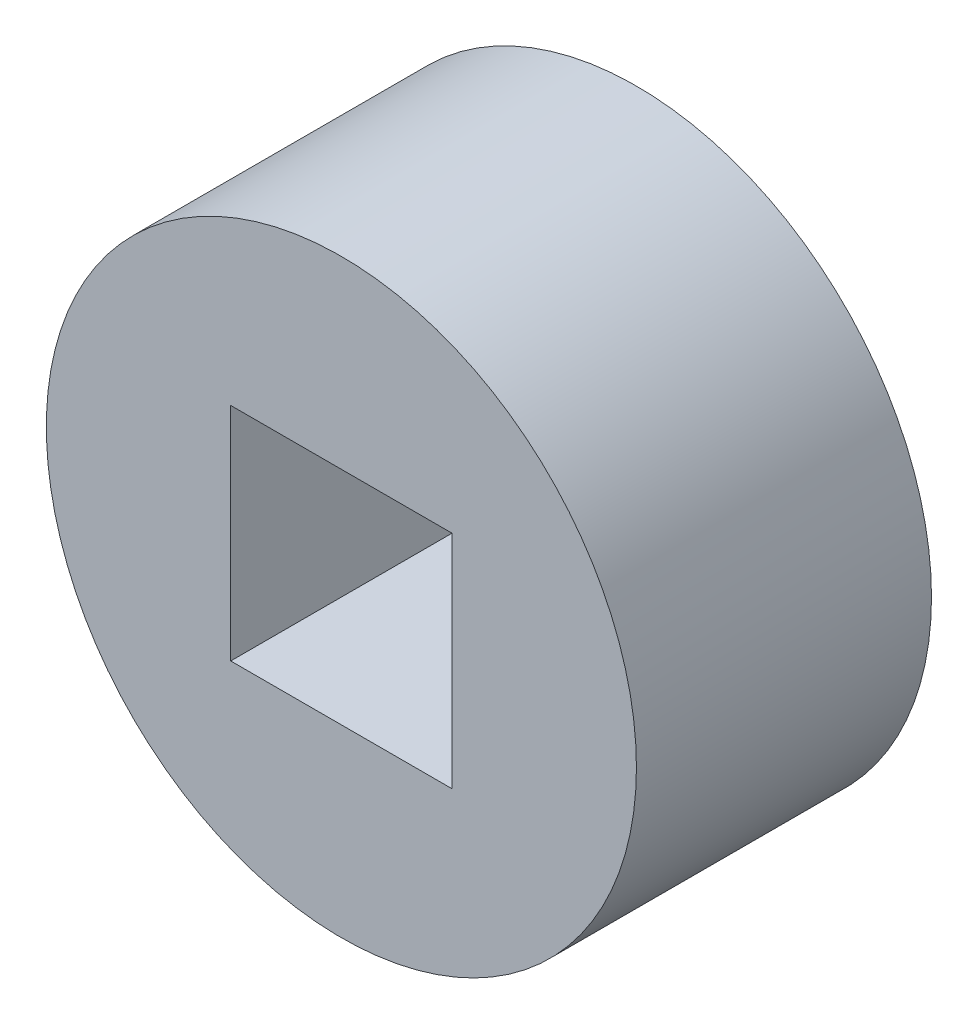
ISO-10303-21;
HEADER;
FILE_DESCRIPTION(('STEP AP214'),'2;1');
FILE_NAME('part.step','',(''),(''),'','','');
FILE_SCHEMA(('AUTOMOTIVE_DESIGN { 1 0 10303 214 1 1 1 1 }'));
ENDSEC;
DATA;
#1=APPLICATION_CONTEXT('core data for automotive mechanical design processes');
#2=APPLICATION_PROTOCOL_DEFINITION('international standard','automotive_design',2000,#1);
#3=PRODUCT_CONTEXT('',#1,'mechanical');
#4=PRODUCT('Part','Part','',(#3));
#5=PRODUCT_RELATED_PRODUCT_CATEGORY('part','',(#4));
#6=PRODUCT_DEFINITION_FORMATION('','',#4);
#7=PRODUCT_DEFINITION_CONTEXT('part definition',#1,'design');
#8=PRODUCT_DEFINITION('design','',#6,#7);
#9=PRODUCT_DEFINITION_SHAPE('','',#8);
#10=(LENGTH_UNIT() NAMED_UNIT(*) SI_UNIT(.MILLI.,.METRE.));
#11=(NAMED_UNIT(*) PLANE_ANGLE_UNIT() SI_UNIT($,.RADIAN.));
#12=(NAMED_UNIT(*) SI_UNIT($,.STERADIAN.) SOLID_ANGLE_UNIT());
#13=UNCERTAINTY_MEASURE_WITH_UNIT(LENGTH_MEASURE(1.E-05),#10,'distance_accuracy_value','');
#14=(GEOMETRIC_REPRESENTATION_CONTEXT(3) GLOBAL_UNCERTAINTY_ASSIGNED_CONTEXT((#13)) GLOBAL_UNIT_ASSIGNED_CONTEXT((#10,
#11,#12)) REPRESENTATION_CONTEXT('',''));
#15=CARTESIAN_POINT('',(0.,0.,0.));
#16=DIRECTION('',(0.,0.,1.));
#17=DIRECTION('',(1.,0.,0.));
#18=AXIS2_PLACEMENT_3D('',#15,#16,#17);
#19=CARTESIAN_POINT('',(0.,0.,4.));
#20=DIRECTION('',(0.,0.,1.));
#21=DIRECTION('',(1.,0.,0.));
#22=AXIS2_PLACEMENT_3D('',#19,#20,#21);
#23=PLANE('',#22);
#24=CARTESIAN_POINT('',(0.,0.,4.));
#25=DIRECTION('',(0.,0.,1.));
#26=DIRECTION('',(1.,0.,0.));
#27=AXIS2_PLACEMENT_3D('',#24,#25,#26);
#28=CIRCLE('',#27,4.);
#29=CARTESIAN_POINT('',(4.,0.,4.));
#30=VERTEX_POINT('',#29);
#31=EDGE_CURVE('E11',#30,#30,#28,.T.);
#32=ORIENTED_EDGE('',*,*,#31,.T.);
#33=EDGE_LOOP('',(#32));
#34=FACE_BOUND('',#33,.T.);
#35=DIRECTION('',(-1.,0.,0.));
#36=VECTOR('',#35,1.);
#37=CARTESIAN_POINT('',(-1.5,1.5,4.));
#38=LINE('',#37,#36);
#39=CARTESIAN_POINT('',(1.5,1.5,4.));
#40=VERTEX_POINT('',#39);
#41=CARTESIAN_POINT('',(-1.5,1.5,4.));
#42=VERTEX_POINT('',#41);
#43=EDGE_CURVE('E90',#40,#42,#38,.T.);
#44=ORIENTED_EDGE('',*,*,#43,.F.);
#45=DIRECTION('',(0.,1.,0.));
#46=VECTOR('',#45,1.);
#47=CARTESIAN_POINT('',(1.5,-1.5,4.));
#48=LINE('',#47,#46);
#49=CARTESIAN_POINT('',(1.5,-1.5,4.));
#50=VERTEX_POINT('',#49);
#51=EDGE_CURVE('E81',#50,#40,#48,.T.);
#52=ORIENTED_EDGE('',*,*,#51,.F.);
#53=DIRECTION('',(1.,0.,0.));
#54=VECTOR('',#53,1.);
#55=CARTESIAN_POINT('',(-1.5,-1.5,4.));
#56=LINE('',#55,#54);
#57=CARTESIAN_POINT('',(-1.5,-1.5,4.));
#58=VERTEX_POINT('',#57);
#59=EDGE_CURVE('E106',#58,#50,#56,.T.);
#60=ORIENTED_EDGE('',*,*,#59,.F.);
#61=DIRECTION('',(0.,-1.,0.));
#62=VECTOR('',#61,1.);
#63=CARTESIAN_POINT('',(-1.5,-1.5,4.));
#64=LINE('',#63,#62);
#65=EDGE_CURVE('E102',#42,#58,#64,.T.);
#66=ORIENTED_EDGE('',*,*,#65,.F.);
#67=EDGE_LOOP('',(#44,#52,#60,#66));
#68=FACE_BOUND('',#67,.T.);
#69=ADVANCED_FACE('F39',(#34,#68),#23,.T.);
#70=CARTESIAN_POINT('',(0.,0.,0.));
#71=DIRECTION('',(0.,0.,1.));
#72=DIRECTION('',(1.,0.,0.));
#73=AXIS2_PLACEMENT_3D('',#70,#71,#72);
#74=PLANE('',#73);
#75=CARTESIAN_POINT('',(0.,0.,0.));
#76=DIRECTION('',(0.,0.,1.));
#77=DIRECTION('',(1.,0.,0.));
#78=AXIS2_PLACEMENT_3D('',#75,#76,#77);
#79=CIRCLE('',#78,4.);
#80=CARTESIAN_POINT('',(4.,0.,0.));
#81=VERTEX_POINT('',#80);
#82=EDGE_CURVE('E43',#81,#81,#79,.T.);
#83=ORIENTED_EDGE('',*,*,#82,.F.);
#84=EDGE_LOOP('',(#83));
#85=FACE_BOUND('',#84,.T.);
#86=DIRECTION('',(0.,1.,0.));
#87=VECTOR('',#86,1.);
#88=CARTESIAN_POINT('',(1.5,-1.5,0.));
#89=LINE('',#88,#87);
#90=CARTESIAN_POINT('',(1.5,-1.5,0.));
#91=VERTEX_POINT('',#90);
#92=CARTESIAN_POINT('',(1.5,1.5,0.));
#93=VERTEX_POINT('',#92);
#94=EDGE_CURVE('E63',#91,#93,#89,.T.);
#95=ORIENTED_EDGE('',*,*,#94,.T.);
#96=DIRECTION('',(-1.,0.,0.));
#97=VECTOR('',#96,1.);
#98=CARTESIAN_POINT('',(-1.5,1.5,0.));
#99=LINE('',#98,#97);
#100=CARTESIAN_POINT('',(-1.5,1.5,0.));
#101=VERTEX_POINT('',#100);
#102=EDGE_CURVE('E97',#93,#101,#99,.T.);
#103=ORIENTED_EDGE('',*,*,#102,.T.);
#104=DIRECTION('',(0.,-1.,0.));
#105=VECTOR('',#104,1.);
#106=CARTESIAN_POINT('',(-1.5,-1.5,0.));
#107=LINE('',#106,#105);
#108=CARTESIAN_POINT('',(-1.5,-1.5,0.));
#109=VERTEX_POINT('',#108);
#110=EDGE_CURVE('E115',#101,#109,#107,.T.);
#111=ORIENTED_EDGE('',*,*,#110,.T.);
#112=DIRECTION('',(1.,0.,0.));
#113=VECTOR('',#112,1.);
#114=CARTESIAN_POINT('',(-1.5,-1.5,0.));
#115=LINE('',#114,#113);
#116=EDGE_CURVE('E91',#109,#91,#115,.T.);
#117=ORIENTED_EDGE('',*,*,#116,.T.);
#118=EDGE_LOOP('',(#95,#103,#111,#117));
#119=FACE_BOUND('',#118,.T.);
#120=ADVANCED_FACE('F131',(#85,#119),#74,.F.);
#121=CARTESIAN_POINT('',(0.,0.,4.));
#122=DIRECTION('',(0.,0.,-1.));
#123=DIRECTION('',(-1.,0.,0.));
#124=AXIS2_PLACEMENT_3D('',#121,#122,#123);
#125=CYLINDRICAL_SURFACE('',#124,4.);
#126=ORIENTED_EDGE('',*,*,#31,.F.);
#127=EDGE_LOOP('',(#126));
#128=FACE_BOUND('',#127,.T.);
#129=ORIENTED_EDGE('',*,*,#82,.T.);
#130=EDGE_LOOP('',(#129));
#131=FACE_BOUND('',#130,.T.);
#132=ADVANCED_FACE('F41',(#128,#131),#125,.T.);
#133=CARTESIAN_POINT('',(1.5,-1.5,4.));
#134=DIRECTION('',(-1.,0.,0.));
#135=DIRECTION('',(0.,0.,1.));
#136=AXIS2_PLACEMENT_3D('',#133,#134,#135);
#137=PLANE('',#136);
#138=ORIENTED_EDGE('',*,*,#94,.F.);
#139=DIRECTION('',(0.,0.,-1.));
#140=VECTOR('',#139,1.);
#141=CARTESIAN_POINT('',(1.5,-1.5,4.));
#142=LINE('',#141,#140);
#143=EDGE_CURVE('E85',#50,#91,#142,.T.);
#144=ORIENTED_EDGE('',*,*,#143,.F.);
#145=ORIENTED_EDGE('',*,*,#51,.T.);
#146=DIRECTION('',(0.,0.,-1.));
#147=VECTOR('',#146,1.);
#148=CARTESIAN_POINT('',(1.5,1.5,4.));
#149=LINE('',#148,#147);
#150=EDGE_CURVE('E84',#40,#93,#149,.T.);
#151=ORIENTED_EDGE('',*,*,#150,.T.);
#152=EDGE_LOOP('',(#138,#144,#145,#151));
#153=FACE_BOUND('',#152,.T.);
#154=ADVANCED_FACE('F83',(#153),#137,.T.);
#155=CARTESIAN_POINT('',(-1.5,1.5,4.));
#156=DIRECTION('',(0.,-1.,0.));
#157=DIRECTION('',(0.,0.,-1.));
#158=AXIS2_PLACEMENT_3D('',#155,#156,#157);
#159=PLANE('',#158);
#160=ORIENTED_EDGE('',*,*,#102,.F.);
#161=ORIENTED_EDGE('',*,*,#150,.F.);
#162=ORIENTED_EDGE('',*,*,#43,.T.);
#163=DIRECTION('',(0.,0.,-1.));
#164=VECTOR('',#163,1.);
#165=CARTESIAN_POINT('',(-1.5,1.5,4.));
#166=LINE('',#165,#164);
#167=EDGE_CURVE('E99',#42,#101,#166,.T.);
#168=ORIENTED_EDGE('',*,*,#167,.T.);
#169=EDGE_LOOP('',(#160,#161,#162,#168));
#170=FACE_BOUND('',#169,.T.);
#171=ADVANCED_FACE('F94',(#170),#159,.T.);
#172=CARTESIAN_POINT('',(-1.5,-1.5,4.));
#173=DIRECTION('',(1.,0.,0.));
#174=DIRECTION('',(0.,0.,-1.));
#175=AXIS2_PLACEMENT_3D('',#172,#173,#174);
#176=PLANE('',#175);
#177=ORIENTED_EDGE('',*,*,#110,.F.);
#178=ORIENTED_EDGE('',*,*,#167,.F.);
#179=ORIENTED_EDGE('',*,*,#65,.T.);
#180=DIRECTION('',(0.,0.,-1.));
#181=VECTOR('',#180,1.);
#182=CARTESIAN_POINT('',(-1.5,-1.5,4.));
#183=LINE('',#182,#181);
#184=EDGE_CURVE('E55',#58,#109,#183,.T.);
#185=ORIENTED_EDGE('',*,*,#184,.T.);
#186=EDGE_LOOP('',(#177,#178,#179,#185));
#187=FACE_BOUND('',#186,.T.);
#188=ADVANCED_FACE('F129',(#187),#176,.T.);
#189=CARTESIAN_POINT('',(-1.5,-1.5,4.));
#190=DIRECTION('',(0.,1.,0.));
#191=DIRECTION('',(0.,0.,1.));
#192=AXIS2_PLACEMENT_3D('',#189,#190,#191);
#193=PLANE('',#192);
#194=ORIENTED_EDGE('',*,*,#116,.F.);
#195=ORIENTED_EDGE('',*,*,#184,.F.);
#196=ORIENTED_EDGE('',*,*,#59,.T.);
#197=ORIENTED_EDGE('',*,*,#143,.T.);
#198=EDGE_LOOP('',(#194,#195,#196,#197));
#199=FACE_BOUND('',#198,.T.);
#200=ADVANCED_FACE('F132',(#199),#193,.T.);
#201=CLOSED_SHELL('',(#69,#120,#132,#154,#171,#188,#200));
#202=MANIFOLD_SOLID_BREP('B2',#201);
#203=ADVANCED_BREP_SHAPE_REPRESENTATION('',(#18,#202),#14);
#204=SHAPE_DEFINITION_REPRESENTATION(#9,#203);
ENDSEC;
END-ISO-10303-21;
